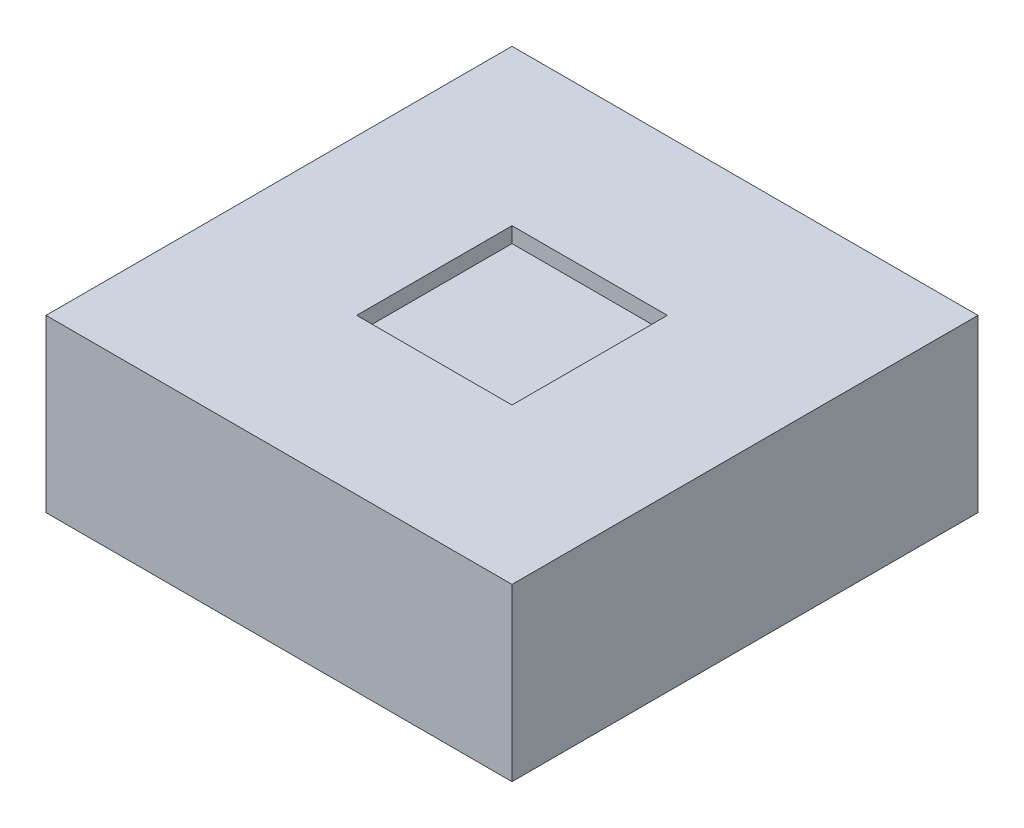
ISO-10303-21;
HEADER;
FILE_DESCRIPTION(('STEP AP214'),'2;1');
FILE_NAME('part.step','',(''),(''),'','','');
FILE_SCHEMA(('AUTOMOTIVE_DESIGN { 1 0 10303 214 1 1 1 1 }'));
ENDSEC;
DATA;
#1=APPLICATION_CONTEXT('core data for automotive mechanical design processes');
#2=APPLICATION_PROTOCOL_DEFINITION('international standard','automotive_design',2000,#1);
#3=PRODUCT_CONTEXT('',#1,'mechanical');
#4=PRODUCT('Part','Part','',(#3));
#5=PRODUCT_RELATED_PRODUCT_CATEGORY('part','',(#4));
#6=PRODUCT_DEFINITION_FORMATION('','',#4);
#7=PRODUCT_DEFINITION_CONTEXT('part definition',#1,'design');
#8=PRODUCT_DEFINITION('design','',#6,#7);
#9=PRODUCT_DEFINITION_SHAPE('','',#8);
#10=(LENGTH_UNIT() NAMED_UNIT(*) SI_UNIT(.MILLI.,.METRE.));
#11=(NAMED_UNIT(*) PLANE_ANGLE_UNIT() SI_UNIT($,.RADIAN.));
#12=(NAMED_UNIT(*) SI_UNIT($,.STERADIAN.) SOLID_ANGLE_UNIT());
#13=UNCERTAINTY_MEASURE_WITH_UNIT(LENGTH_MEASURE(1.E-05),#10,'distance_accuracy_value','');
#14=(GEOMETRIC_REPRESENTATION_CONTEXT(3) GLOBAL_UNCERTAINTY_ASSIGNED_CONTEXT((#13)) GLOBAL_UNIT_ASSIGNED_CONTEXT((#10,
#11,#12)) REPRESENTATION_CONTEXT('',''));
#15=CARTESIAN_POINT('',(0.,0.,0.));
#16=DIRECTION('',(0.,0.,1.));
#17=DIRECTION('',(1.,0.,0.));
#18=AXIS2_PLACEMENT_3D('',#15,#16,#17);
#19=CARTESIAN_POINT('',(15.,10.,15.));
#20=DIRECTION('',(-1.,0.,0.));
#21=DIRECTION('',(0.,0.,1.));
#22=AXIS2_PLACEMENT_3D('',#19,#20,#21);
#23=PLANE('',#22);
#24=DIRECTION('',(0.,0.,-1.));
#25=VECTOR('',#24,1.);
#26=CARTESIAN_POINT('',(15.,0.,15.));
#27=LINE('',#26,#25);
#28=CARTESIAN_POINT('',(15.,0.,15.));
#29=VERTEX_POINT('',#28);
#30=CARTESIAN_POINT('',(15.,0.,-15.));
#31=VERTEX_POINT('',#30);
#32=EDGE_CURVE('E150',#29,#31,#27,.T.);
#33=ORIENTED_EDGE('',*,*,#32,.T.);
#34=DIRECTION('',(0.,-1.,0.));
#35=VECTOR('',#34,1.);
#36=CARTESIAN_POINT('',(15.,10.,-15.));
#37=LINE('',#36,#35);
#38=CARTESIAN_POINT('',(15.,11.,-15.));
#39=VERTEX_POINT('',#38);
#40=EDGE_CURVE('E11',#39,#31,#37,.T.);
#41=ORIENTED_EDGE('',*,*,#40,.F.);
#42=DIRECTION('',(0.,0.,-1.));
#43=VECTOR('',#42,1.);
#44=CARTESIAN_POINT('',(15.,11.,15.));
#45=LINE('',#44,#43);
#46=CARTESIAN_POINT('',(15.,11.,15.));
#47=VERTEX_POINT('',#46);
#48=EDGE_CURVE('E115',#47,#39,#45,.T.);
#49=ORIENTED_EDGE('',*,*,#48,.F.);
#50=DIRECTION('',(0.,-1.,0.));
#51=VECTOR('',#50,1.);
#52=CARTESIAN_POINT('',(15.,10.,15.));
#53=LINE('',#52,#51);
#54=EDGE_CURVE('E158',#47,#29,#53,.T.);
#55=ORIENTED_EDGE('',*,*,#54,.T.);
#56=EDGE_LOOP('',(#33,#41,#49,#55));
#57=FACE_BOUND('',#56,.T.);
#58=ADVANCED_FACE('F33',(#57),#23,.F.);
#59=CARTESIAN_POINT('',(-15.,10.,-15.));
#60=DIRECTION('',(0.,0.,1.));
#61=DIRECTION('',(1.,0.,0.));
#62=AXIS2_PLACEMENT_3D('',#59,#60,#61);
#63=PLANE('',#62);
#64=DIRECTION('',(-1.,0.,0.));
#65=VECTOR('',#64,1.);
#66=CARTESIAN_POINT('',(-15.,0.,-15.));
#67=LINE('',#66,#65);
#68=CARTESIAN_POINT('',(-15.,0.,-15.));
#69=VERTEX_POINT('',#68);
#70=EDGE_CURVE('E153',#31,#69,#67,.T.);
#71=ORIENTED_EDGE('',*,*,#70,.T.);
#72=DIRECTION('',(0.,-1.,0.));
#73=VECTOR('',#72,1.);
#74=CARTESIAN_POINT('',(-15.,10.,-15.));
#75=LINE('',#74,#73);
#76=CARTESIAN_POINT('',(-15.,11.,-15.));
#77=VERTEX_POINT('',#76);
#78=EDGE_CURVE('E40',#77,#69,#75,.T.);
#79=ORIENTED_EDGE('',*,*,#78,.F.);
#80=DIRECTION('',(-1.,0.,0.));
#81=VECTOR('',#80,1.);
#82=CARTESIAN_POINT('',(-15.,11.,-15.));
#83=LINE('',#82,#81);
#84=EDGE_CURVE('E141',#39,#77,#83,.T.);
#85=ORIENTED_EDGE('',*,*,#84,.F.);
#86=ORIENTED_EDGE('',*,*,#40,.T.);
#87=EDGE_LOOP('',(#71,#79,#85,#86));
#88=FACE_BOUND('',#87,.T.);
#89=ADVANCED_FACE('F176',(#88),#63,.F.);
#90=CARTESIAN_POINT('',(-15.,10.,15.));
#91=DIRECTION('',(1.,0.,0.));
#92=DIRECTION('',(0.,0.,-1.));
#93=AXIS2_PLACEMENT_3D('',#90,#91,#92);
#94=PLANE('',#93);
#95=DIRECTION('',(0.,0.,1.));
#96=VECTOR('',#95,1.);
#97=CARTESIAN_POINT('',(-15.,0.,15.));
#98=LINE('',#97,#96);
#99=CARTESIAN_POINT('',(-15.,0.,15.));
#100=VERTEX_POINT('',#99);
#101=EDGE_CURVE('E155',#69,#100,#98,.T.);
#102=ORIENTED_EDGE('',*,*,#101,.T.);
#103=DIRECTION('',(0.,-1.,0.));
#104=VECTOR('',#103,1.);
#105=CARTESIAN_POINT('',(-15.,10.,15.));
#106=LINE('',#105,#104);
#107=CARTESIAN_POINT('',(-15.,11.,15.));
#108=VERTEX_POINT('',#107);
#109=EDGE_CURVE('E160',#108,#100,#106,.T.);
#110=ORIENTED_EDGE('',*,*,#109,.F.);
#111=DIRECTION('',(0.,0.,1.));
#112=VECTOR('',#111,1.);
#113=CARTESIAN_POINT('',(-15.,11.,15.));
#114=LINE('',#113,#112);
#115=EDGE_CURVE('E144',#77,#108,#114,.T.);
#116=ORIENTED_EDGE('',*,*,#115,.F.);
#117=ORIENTED_EDGE('',*,*,#78,.T.);
#118=EDGE_LOOP('',(#102,#110,#116,#117));
#119=FACE_BOUND('',#118,.T.);
#120=ADVANCED_FACE('F165',(#119),#94,.F.);
#121=CARTESIAN_POINT('',(-15.,10.,15.));
#122=DIRECTION('',(0.,0.,-1.));
#123=DIRECTION('',(-1.,0.,0.));
#124=AXIS2_PLACEMENT_3D('',#121,#122,#123);
#125=PLANE('',#124);
#126=DIRECTION('',(1.,0.,0.));
#127=VECTOR('',#126,1.);
#128=CARTESIAN_POINT('',(-15.,0.,15.));
#129=LINE('',#128,#127);
#130=EDGE_CURVE('E55',#100,#29,#129,.T.);
#131=ORIENTED_EDGE('',*,*,#130,.T.);
#132=ORIENTED_EDGE('',*,*,#54,.F.);
#133=DIRECTION('',(1.,0.,0.));
#134=VECTOR('',#133,1.);
#135=CARTESIAN_POINT('',(-15.,11.,15.));
#136=LINE('',#135,#134);
#137=EDGE_CURVE('E147',#108,#47,#136,.T.);
#138=ORIENTED_EDGE('',*,*,#137,.F.);
#139=ORIENTED_EDGE('',*,*,#109,.T.);
#140=EDGE_LOOP('',(#131,#132,#138,#139));
#141=FACE_BOUND('',#140,.T.);
#142=ADVANCED_FACE('F174',(#141),#125,.F.);
#143=CARTESIAN_POINT('',(0.,0.,0.));
#144=DIRECTION('',(0.,-1.,0.));
#145=DIRECTION('',(0.,0.,-1.));
#146=AXIS2_PLACEMENT_3D('',#143,#144,#145);
#147=PLANE('',#146);
#148=ORIENTED_EDGE('',*,*,#32,.F.);
#149=ORIENTED_EDGE('',*,*,#130,.F.);
#150=ORIENTED_EDGE('',*,*,#101,.F.);
#151=ORIENTED_EDGE('',*,*,#70,.F.);
#152=EDGE_LOOP('',(#148,#149,#150,#151));
#153=FACE_BOUND('',#152,.T.);
#154=ADVANCED_FACE('F170',(#153),#147,.T.);
#155=CARTESIAN_POINT('',(0.,11.,0.));
#156=DIRECTION('',(0.,-1.,0.));
#157=DIRECTION('',(0.,0.,-1.));
#158=AXIS2_PLACEMENT_3D('',#155,#156,#157);
#159=PLANE('',#158);
#160=ORIENTED_EDGE('',*,*,#48,.T.);
#161=ORIENTED_EDGE('',*,*,#84,.T.);
#162=ORIENTED_EDGE('',*,*,#115,.T.);
#163=ORIENTED_EDGE('',*,*,#137,.T.);
#164=EDGE_LOOP('',(#160,#161,#162,#163));
#165=FACE_BOUND('',#164,.T.);
#166=DIRECTION('',(0.,0.,-1.));
#167=VECTOR('',#166,1.);
#168=CARTESIAN_POINT('',(5.,11.,5.));
#169=LINE('',#168,#167);
#170=CARTESIAN_POINT('',(5.,11.,5.));
#171=VERTEX_POINT('',#170);
#172=CARTESIAN_POINT('',(5.,11.,-5.));
#173=VERTEX_POINT('',#172);
#174=EDGE_CURVE('E99',#171,#173,#169,.T.);
#175=ORIENTED_EDGE('',*,*,#174,.F.);
#176=DIRECTION('',(1.,0.,0.));
#177=VECTOR('',#176,1.);
#178=CARTESIAN_POINT('',(-5.,11.,5.));
#179=LINE('',#178,#177);
#180=CARTESIAN_POINT('',(-5.,11.,5.));
#181=VERTEX_POINT('',#180);
#182=EDGE_CURVE('E123',#181,#171,#179,.T.);
#183=ORIENTED_EDGE('',*,*,#182,.F.);
#184=DIRECTION('',(0.,0.,1.));
#185=VECTOR('',#184,1.);
#186=CARTESIAN_POINT('',(-5.,11.,5.));
#187=LINE('',#186,#185);
#188=CARTESIAN_POINT('',(-5.,11.,-5.));
#189=VERTEX_POINT('',#188);
#190=EDGE_CURVE('E121',#189,#181,#187,.T.);
#191=ORIENTED_EDGE('',*,*,#190,.F.);
#192=DIRECTION('',(-1.,0.,0.));
#193=VECTOR('',#192,1.);
#194=CARTESIAN_POINT('',(-5.,11.,-5.));
#195=LINE('',#194,#193);
#196=EDGE_CURVE('E107',#173,#189,#195,.T.);
#197=ORIENTED_EDGE('',*,*,#196,.F.);
#198=EDGE_LOOP('',(#175,#183,#191,#197));
#199=FACE_BOUND('',#198,.T.);
#200=ADVANCED_FACE('F119',(#165,#199),#159,.F.);
#201=CARTESIAN_POINT('',(5.,11.,5.));
#202=DIRECTION('',(-1.,0.,0.));
#203=DIRECTION('',(0.,0.,1.));
#204=AXIS2_PLACEMENT_3D('',#201,#202,#203);
#205=PLANE('',#204);
#206=DIRECTION('',(0.,0.,-1.));
#207=VECTOR('',#206,1.);
#208=CARTESIAN_POINT('',(5.,10.,5.));
#209=LINE('',#208,#207);
#210=CARTESIAN_POINT('',(5.,10.,5.));
#211=VERTEX_POINT('',#210);
#212=CARTESIAN_POINT('',(5.,10.,-5.));
#213=VERTEX_POINT('',#212);
#214=EDGE_CURVE('E127',#211,#213,#209,.T.);
#215=ORIENTED_EDGE('',*,*,#214,.F.);
#216=DIRECTION('',(0.,-1.,0.));
#217=VECTOR('',#216,1.);
#218=CARTESIAN_POINT('',(5.,11.,5.));
#219=LINE('',#218,#217);
#220=EDGE_CURVE('E47',#171,#211,#219,.T.);
#221=ORIENTED_EDGE('',*,*,#220,.F.);
#222=ORIENTED_EDGE('',*,*,#174,.T.);
#223=DIRECTION('',(0.,-1.,0.));
#224=VECTOR('',#223,1.);
#225=CARTESIAN_POINT('',(5.,11.,-5.));
#226=LINE('',#225,#224);
#227=EDGE_CURVE('E102',#173,#213,#226,.T.);
#228=ORIENTED_EDGE('',*,*,#227,.T.);
#229=EDGE_LOOP('',(#215,#221,#222,#228));
#230=FACE_BOUND('',#229,.T.);
#231=ADVANCED_FACE('F101',(#230),#205,.T.);
#232=CARTESIAN_POINT('',(-5.,11.,-5.));
#233=DIRECTION('',(0.,0.,1.));
#234=DIRECTION('',(1.,0.,0.));
#235=AXIS2_PLACEMENT_3D('',#232,#233,#234);
#236=PLANE('',#235);
#237=DIRECTION('',(-1.,0.,0.));
#238=VECTOR('',#237,1.);
#239=CARTESIAN_POINT('',(-5.,10.,-5.));
#240=LINE('',#239,#238);
#241=CARTESIAN_POINT('',(-5.,10.,-5.));
#242=VERTEX_POINT('',#241);
#243=EDGE_CURVE('E114',#213,#242,#240,.T.);
#244=ORIENTED_EDGE('',*,*,#243,.F.);
#245=ORIENTED_EDGE('',*,*,#227,.F.);
#246=ORIENTED_EDGE('',*,*,#196,.T.);
#247=DIRECTION('',(0.,-1.,0.));
#248=VECTOR('',#247,1.);
#249=CARTESIAN_POINT('',(-5.,11.,-5.));
#250=LINE('',#249,#248);
#251=EDGE_CURVE('E116',#189,#242,#250,.T.);
#252=ORIENTED_EDGE('',*,*,#251,.T.);
#253=EDGE_LOOP('',(#244,#245,#246,#252));
#254=FACE_BOUND('',#253,.T.);
#255=ADVANCED_FACE('F111',(#254),#236,.T.);
#256=CARTESIAN_POINT('',(-5.,11.,5.));
#257=DIRECTION('',(1.,0.,0.));
#258=DIRECTION('',(0.,0.,-1.));
#259=AXIS2_PLACEMENT_3D('',#256,#257,#258);
#260=PLANE('',#259);
#261=DIRECTION('',(0.,0.,1.));
#262=VECTOR('',#261,1.);
#263=CARTESIAN_POINT('',(-5.,10.,5.));
#264=LINE('',#263,#262);
#265=CARTESIAN_POINT('',(-5.,10.,5.));
#266=VERTEX_POINT('',#265);
#267=EDGE_CURVE('E130',#242,#266,#264,.T.);
#268=ORIENTED_EDGE('',*,*,#267,.F.);
#269=ORIENTED_EDGE('',*,*,#251,.F.);
#270=ORIENTED_EDGE('',*,*,#190,.T.);
#271=DIRECTION('',(0.,-1.,0.));
#272=VECTOR('',#271,1.);
#273=CARTESIAN_POINT('',(-5.,11.,5.));
#274=LINE('',#273,#272);
#275=EDGE_CURVE('E136',#181,#266,#274,.T.);
#276=ORIENTED_EDGE('',*,*,#275,.T.);
#277=EDGE_LOOP('',(#268,#269,#270,#276));
#278=FACE_BOUND('',#277,.T.);
#279=ADVANCED_FACE('F199',(#278),#260,.T.);
#280=CARTESIAN_POINT('',(-5.,11.,5.));
#281=DIRECTION('',(0.,0.,-1.));
#282=DIRECTION('',(-1.,0.,0.));
#283=AXIS2_PLACEMENT_3D('',#280,#281,#282);
#284=PLANE('',#283);
#285=DIRECTION('',(1.,0.,0.));
#286=VECTOR('',#285,1.);
#287=CARTESIAN_POINT('',(-5.,10.,5.));
#288=LINE('',#287,#286);
#289=EDGE_CURVE('E108',#266,#211,#288,.T.);
#290=ORIENTED_EDGE('',*,*,#289,.F.);
#291=ORIENTED_EDGE('',*,*,#275,.F.);
#292=ORIENTED_EDGE('',*,*,#182,.T.);
#293=ORIENTED_EDGE('',*,*,#220,.T.);
#294=EDGE_LOOP('',(#290,#291,#292,#293));
#295=FACE_BOUND('',#294,.T.);
#296=ADVANCED_FACE('F191',(#295),#284,.T.);
#297=CARTESIAN_POINT('',(0.,10.,0.));
#298=DIRECTION('',(0.,-1.,0.));
#299=DIRECTION('',(0.,0.,-1.));
#300=AXIS2_PLACEMENT_3D('',#297,#298,#299);
#301=PLANE('',#300);
#302=ORIENTED_EDGE('',*,*,#289,.T.);
#303=ORIENTED_EDGE('',*,*,#214,.T.);
#304=ORIENTED_EDGE('',*,*,#243,.T.);
#305=ORIENTED_EDGE('',*,*,#267,.T.);
#306=EDGE_LOOP('',(#302,#303,#304,#305));
#307=FACE_BOUND('',#306,.T.);
#308=ADVANCED_FACE('F188',(#307),#301,.F.);
#309=CLOSED_SHELL('',(#58,#89,#120,#142,#154,#200,#231,#255,#279,#296,#308));
#310=MANIFOLD_SOLID_BREP('B2',#309);
#311=ADVANCED_BREP_SHAPE_REPRESENTATION('',(#18,#310),#14);
#312=SHAPE_DEFINITION_REPRESENTATION(#9,#311);
ENDSEC;
END-ISO-10303-21;
